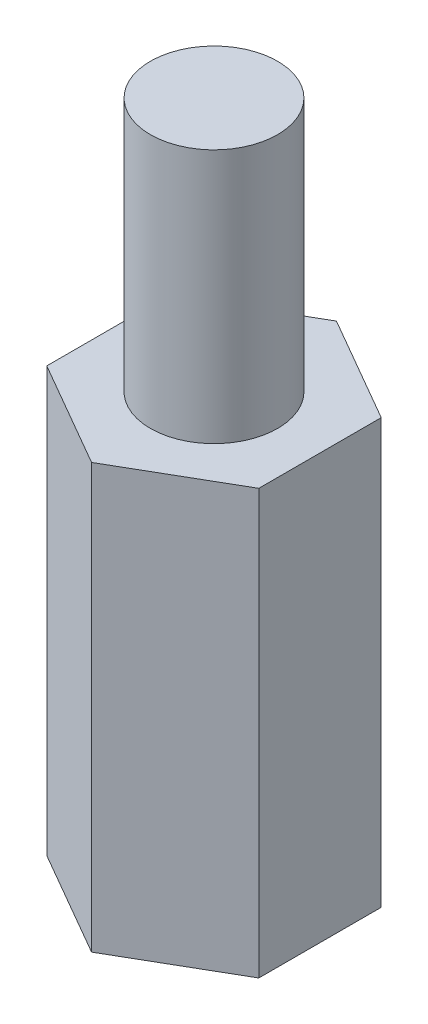
ISO-10303-21;
HEADER;
FILE_DESCRIPTION(('STEP AP214'),'2;1');
FILE_NAME('part.step','',(''),(''),'','','');
FILE_SCHEMA(('AUTOMOTIVE_DESIGN { 1 0 10303 214 1 1 1 1 }'));
ENDSEC;
DATA;
#1=APPLICATION_CONTEXT('core data for automotive mechanical design processes');
#2=APPLICATION_PROTOCOL_DEFINITION('international standard','automotive_design',2000,#1);
#3=PRODUCT_CONTEXT('',#1,'mechanical');
#4=PRODUCT('Part','Part','',(#3));
#5=PRODUCT_RELATED_PRODUCT_CATEGORY('part','',(#4));
#6=PRODUCT_DEFINITION_FORMATION('','',#4);
#7=PRODUCT_DEFINITION_CONTEXT('part definition',#1,'design');
#8=PRODUCT_DEFINITION('design','',#6,#7);
#9=PRODUCT_DEFINITION_SHAPE('','',#8);
#10=(LENGTH_UNIT() NAMED_UNIT(*) SI_UNIT(.MILLI.,.METRE.));
#11=(NAMED_UNIT(*) PLANE_ANGLE_UNIT() SI_UNIT($,.RADIAN.));
#12=(NAMED_UNIT(*) SI_UNIT($,.STERADIAN.) SOLID_ANGLE_UNIT());
#13=UNCERTAINTY_MEASURE_WITH_UNIT(LENGTH_MEASURE(1.E-05),#10,'distance_accuracy_value','');
#14=(GEOMETRIC_REPRESENTATION_CONTEXT(3) GLOBAL_UNCERTAINTY_ASSIGNED_CONTEXT((#13)) GLOBAL_UNIT_ASSIGNED_CONTEXT((#10,
#11,#12)) REPRESENTATION_CONTEXT('',''));
#15=CARTESIAN_POINT('',(0.,0.,0.));
#16=DIRECTION('',(0.,0.,1.));
#17=DIRECTION('',(1.,0.,0.));
#18=AXIS2_PLACEMENT_3D('',#15,#16,#17);
#19=CARTESIAN_POINT('',(2.5,16.,1.44337567297407));
#20=DIRECTION('',(-1.,0.,0.));
#21=DIRECTION('',(0.,0.,1.));
#22=AXIS2_PLACEMENT_3D('',#19,#20,#21);
#23=PLANE('',#22);
#24=DIRECTION('',(0.,0.,-1.));
#25=VECTOR('',#24,1.);
#26=CARTESIAN_POINT('',(2.50000000000001,10.,1.44337567297404));
#27=LINE('',#26,#25);
#28=CARTESIAN_POINT('',(2.50000000000001,10.,1.44337567297404));
#29=VERTEX_POINT('',#28);
#30=CARTESIAN_POINT('',(2.49999999999998,10.,-1.44337567297409));
#31=VERTEX_POINT('',#30);
#32=EDGE_CURVE('E90',#29,#31,#27,.T.);
#33=ORIENTED_EDGE('',*,*,#32,.F.);
#34=DIRECTION('',(0.,-1.,0.));
#35=VECTOR('',#34,1.);
#36=CARTESIAN_POINT('',(2.5,16.,1.44337567297407));
#37=LINE('',#36,#35);
#38=CARTESIAN_POINT('',(2.5,0.,1.44337567297407));
#39=VERTEX_POINT('',#38);
#40=EDGE_CURVE('E56',#29,#39,#37,.T.);
#41=ORIENTED_EDGE('',*,*,#40,.T.);
#42=DIRECTION('',(0.,0.,-1.));
#43=VECTOR('',#42,1.);
#44=CARTESIAN_POINT('',(2.5,0.,1.44337567297407));
#45=LINE('',#44,#43);
#46=CARTESIAN_POINT('',(2.5,0.,-1.44337567297407));
#47=VERTEX_POINT('',#46);
#48=EDGE_CURVE('E126',#39,#47,#45,.T.);
#49=ORIENTED_EDGE('',*,*,#48,.T.);
#50=DIRECTION('',(0.,-1.,0.));
#51=VECTOR('',#50,1.);
#52=CARTESIAN_POINT('',(2.5,16.,-1.44337567297407));
#53=LINE('',#52,#51);
#54=EDGE_CURVE('E11',#31,#47,#53,.T.);
#55=ORIENTED_EDGE('',*,*,#54,.F.);
#56=EDGE_LOOP('',(#33,#41,#49,#55));
#57=FACE_BOUND('',#56,.T.);
#58=ADVANCED_FACE('F34',(#57),#23,.F.);
#59=CARTESIAN_POINT('',(2.5,16.,-1.44337567297407));
#60=DIRECTION('',(-0.5,0.,0.866025403784439));
#61=DIRECTION('',(0.866025403784439,0.,0.5));
#62=AXIS2_PLACEMENT_3D('',#59,#60,#61);
#63=PLANE('',#62);
#64=DIRECTION('',(-0.866025403784442,0.,-0.499999999999995));
#65=VECTOR('',#64,1.);
#66=CARTESIAN_POINT('',(2.49999999999998,10.,-1.44337567297409));
#67=LINE('',#66,#65);
#68=CARTESIAN_POINT('',(0.,10.,-2.88675134594813));
#69=VERTEX_POINT('',#68);
#70=EDGE_CURVE('E85',#31,#69,#67,.T.);
#71=ORIENTED_EDGE('',*,*,#70,.F.);
#72=ORIENTED_EDGE('',*,*,#54,.T.);
#73=DIRECTION('',(-0.866025403784439,0.,-0.5));
#74=VECTOR('',#73,1.);
#75=CARTESIAN_POINT('',(2.5,0.,-1.44337567297407));
#76=LINE('',#75,#74);
#77=CARTESIAN_POINT('',(0.,0.,-2.88675134594813));
#78=VERTEX_POINT('',#77);
#79=EDGE_CURVE('E106',#47,#78,#76,.T.);
#80=ORIENTED_EDGE('',*,*,#79,.T.);
#81=DIRECTION('',(0.,-1.,0.));
#82=VECTOR('',#81,1.);
#83=CARTESIAN_POINT('',(0.,16.,-2.88675134594813));
#84=LINE('',#83,#82);
#85=EDGE_CURVE('E41',#69,#78,#84,.T.);
#86=ORIENTED_EDGE('',*,*,#85,.F.);
#87=EDGE_LOOP('',(#71,#72,#80,#86));
#88=FACE_BOUND('',#87,.T.);
#89=ADVANCED_FACE('F104',(#88),#63,.F.);
#90=CARTESIAN_POINT('',(0.,16.,-2.88675134594813));
#91=DIRECTION('',(0.5,0.,0.866025403784438));
#92=DIRECTION('',(0.866025403784438,0.,-0.5));
#93=AXIS2_PLACEMENT_3D('',#90,#91,#92);
#94=PLANE('',#93);
#95=DIRECTION('',(-0.866025403784438,0.,0.500000000000001));
#96=VECTOR('',#95,1.);
#97=CARTESIAN_POINT('',(0.,10.,-2.88675134594813));
#98=LINE('',#97,#96);
#99=CARTESIAN_POINT('',(-2.5,10.,-1.44337567297406));
#100=VERTEX_POINT('',#99);
#101=EDGE_CURVE('E88',#69,#100,#98,.T.);
#102=ORIENTED_EDGE('',*,*,#101,.F.);
#103=ORIENTED_EDGE('',*,*,#85,.T.);
#104=DIRECTION('',(-0.866025403784438,0.,0.5));
#105=VECTOR('',#104,1.);
#106=CARTESIAN_POINT('',(0.,0.,-2.88675134594813));
#107=LINE('',#106,#105);
#108=CARTESIAN_POINT('',(-2.5,0.,-1.44337567297406));
#109=VERTEX_POINT('',#108);
#110=EDGE_CURVE('E123',#78,#109,#107,.T.);
#111=ORIENTED_EDGE('',*,*,#110,.T.);
#112=DIRECTION('',(0.,-1.,0.));
#113=VECTOR('',#112,1.);
#114=CARTESIAN_POINT('',(-2.5,16.,-1.44337567297406));
#115=LINE('',#114,#113);
#116=EDGE_CURVE('E101',#100,#109,#115,.T.);
#117=ORIENTED_EDGE('',*,*,#116,.F.);
#118=EDGE_LOOP('',(#102,#103,#111,#117));
#119=FACE_BOUND('',#118,.T.);
#120=ADVANCED_FACE('F98',(#119),#94,.F.);
#121=CARTESIAN_POINT('',(-2.5,16.,-1.44337567297406));
#122=DIRECTION('',(1.,0.,0.));
#123=DIRECTION('',(0.,0.,-1.));
#124=AXIS2_PLACEMENT_3D('',#121,#122,#123);
#125=PLANE('',#124);
#126=DIRECTION('',(0.,0.,1.));
#127=VECTOR('',#126,1.);
#128=CARTESIAN_POINT('',(-2.5,10.,-1.44337567297406));
#129=LINE('',#128,#127);
#130=CARTESIAN_POINT('',(-2.49999999999999,10.,1.44337567297408));
#131=VERTEX_POINT('',#130);
#132=EDGE_CURVE('E102',#100,#131,#129,.T.);
#133=ORIENTED_EDGE('',*,*,#132,.F.);
#134=ORIENTED_EDGE('',*,*,#116,.T.);
#135=DIRECTION('',(0.,0.,1.));
#136=VECTOR('',#135,1.);
#137=CARTESIAN_POINT('',(-2.5,0.,-1.44337567297406));
#138=LINE('',#137,#136);
#139=CARTESIAN_POINT('',(-2.5,0.,1.44337567297407));
#140=VERTEX_POINT('',#139);
#141=EDGE_CURVE('E120',#109,#140,#138,.T.);
#142=ORIENTED_EDGE('',*,*,#141,.T.);
#143=DIRECTION('',(0.,-1.,0.));
#144=VECTOR('',#143,1.);
#145=CARTESIAN_POINT('',(-2.5,16.,1.44337567297407));
#146=LINE('',#145,#144);
#147=EDGE_CURVE('E108',#131,#140,#146,.T.);
#148=ORIENTED_EDGE('',*,*,#147,.F.);
#149=EDGE_LOOP('',(#133,#134,#142,#148));
#150=FACE_BOUND('',#149,.T.);
#151=ADVANCED_FACE('F175',(#150),#125,.F.);
#152=CARTESIAN_POINT('',(-2.5,16.,1.44337567297407));
#153=DIRECTION('',(0.5,0.,-0.866025403784439));
#154=DIRECTION('',(-0.866025403784439,0.,-0.5));
#155=AXIS2_PLACEMENT_3D('',#152,#153,#154);
#156=PLANE('',#155);
#157=DIRECTION('',(0.866025403784441,0.,0.499999999999995));
#158=VECTOR('',#157,1.);
#159=CARTESIAN_POINT('',(-2.49999999999999,10.,1.44337567297408));
#160=LINE('',#159,#158);
#161=CARTESIAN_POINT('',(0.,10.,2.88675134594813));
#162=VERTEX_POINT('',#161);
#163=EDGE_CURVE('E48',#131,#162,#160,.T.);
#164=ORIENTED_EDGE('',*,*,#163,.F.);
#165=ORIENTED_EDGE('',*,*,#147,.T.);
#166=DIRECTION('',(0.866025403784439,0.,0.5));
#167=VECTOR('',#166,1.);
#168=CARTESIAN_POINT('',(-2.5,0.,1.44337567297407));
#169=LINE('',#168,#167);
#170=CARTESIAN_POINT('',(0.,0.,2.88675134594813));
#171=VERTEX_POINT('',#170);
#172=EDGE_CURVE('E117',#140,#171,#169,.T.);
#173=ORIENTED_EDGE('',*,*,#172,.T.);
#174=DIRECTION('',(0.,-1.,0.));
#175=VECTOR('',#174,1.);
#176=CARTESIAN_POINT('',(0.,16.,2.88675134594813));
#177=LINE('',#176,#175);
#178=EDGE_CURVE('E112',#162,#171,#177,.T.);
#179=ORIENTED_EDGE('',*,*,#178,.F.);
#180=EDGE_LOOP('',(#164,#165,#173,#179));
#181=FACE_BOUND('',#180,.T.);
#182=ADVANCED_FACE('F177',(#181),#156,.F.);
#183=CARTESIAN_POINT('',(0.,16.,2.88675134594813));
#184=DIRECTION('',(-0.5,0.,-0.866025403784439));
#185=DIRECTION('',(-0.866025403784439,0.,0.5));
#186=AXIS2_PLACEMENT_3D('',#183,#184,#185);
#187=PLANE('',#186);
#188=DIRECTION('',(0.866025403784435,0.,-0.500000000000007));
#189=VECTOR('',#188,1.);
#190=CARTESIAN_POINT('',(0.,10.,2.88675134594813));
#191=LINE('',#190,#189);
#192=EDGE_CURVE('E135',#162,#29,#191,.T.);
#193=ORIENTED_EDGE('',*,*,#192,.F.);
#194=ORIENTED_EDGE('',*,*,#178,.T.);
#195=DIRECTION('',(0.866025403784439,0.,-0.5));
#196=VECTOR('',#195,1.);
#197=CARTESIAN_POINT('',(0.,0.,2.88675134594813));
#198=LINE('',#197,#196);
#199=EDGE_CURVE('E115',#171,#39,#198,.T.);
#200=ORIENTED_EDGE('',*,*,#199,.T.);
#201=ORIENTED_EDGE('',*,*,#40,.F.);
#202=EDGE_LOOP('',(#193,#194,#200,#201));
#203=FACE_BOUND('',#202,.T.);
#204=ADVANCED_FACE('F165',(#203),#187,.F.);
#205=CARTESIAN_POINT('',(0.,0.,0.));
#206=DIRECTION('',(0.,1.,0.));
#207=DIRECTION('',(0.,0.,1.));
#208=AXIS2_PLACEMENT_3D('',#205,#206,#207);
#209=PLANE('',#208);
#210=CARTESIAN_POINT('',(0.,0.,0.));
#211=DIRECTION('',(0.,1.,0.));
#212=DIRECTION('',(0.,0.,1.));
#213=AXIS2_PLACEMENT_3D('',#210,#211,#212);
#214=CIRCLE('',#213,1.5025);
#215=CARTESIAN_POINT('',(0.,0.,1.5025));
#216=VERTEX_POINT('',#215);
#217=EDGE_CURVE('E129',#216,#216,#214,.T.);
#218=ORIENTED_EDGE('',*,*,#217,.T.);
#219=EDGE_LOOP('',(#218));
#220=FACE_BOUND('',#219,.T.);
#221=ORIENTED_EDGE('',*,*,#48,.F.);
#222=ORIENTED_EDGE('',*,*,#199,.F.);
#223=ORIENTED_EDGE('',*,*,#172,.F.);
#224=ORIENTED_EDGE('',*,*,#141,.F.);
#225=ORIENTED_EDGE('',*,*,#110,.F.);
#226=ORIENTED_EDGE('',*,*,#79,.F.);
#227=EDGE_LOOP('',(#221,#222,#223,#224,#225,#226));
#228=FACE_BOUND('',#227,.T.);
#229=ADVANCED_FACE('F171',(#220,#228),#209,.F.);
#230=CARTESIAN_POINT('',(0.,6.005,0.));
#231=DIRECTION('',(0.,-1.,0.));
#232=DIRECTION('',(0.,0.,-1.));
#233=AXIS2_PLACEMENT_3D('',#230,#231,#232);
#234=CYLINDRICAL_SURFACE('',#233,1.5025);
#235=CARTESIAN_POINT('',(0.,6.005,0.));
#236=DIRECTION('',(0.,1.,0.));
#237=DIRECTION('',(0.,0.,1.));
#238=AXIS2_PLACEMENT_3D('',#235,#236,#237);
#239=CIRCLE('',#238,1.5025);
#240=CARTESIAN_POINT('',(0.,6.005,1.5025));
#241=VERTEX_POINT('',#240);
#242=EDGE_CURVE('E128',#241,#241,#239,.T.);
#243=ORIENTED_EDGE('',*,*,#242,.T.);
#244=EDGE_LOOP('',(#243));
#245=FACE_BOUND('',#244,.T.);
#246=ORIENTED_EDGE('',*,*,#217,.F.);
#247=EDGE_LOOP('',(#246));
#248=FACE_BOUND('',#247,.T.);
#249=ADVANCED_FACE('F157',(#245,#248),#234,.F.);
#250=CARTESIAN_POINT('',(0.,6.005,0.));
#251=DIRECTION('',(0.,1.,0.));
#252=DIRECTION('',(0.,0.,1.));
#253=AXIS2_PLACEMENT_3D('',#250,#251,#252);
#254=PLANE('',#253);
#255=ORIENTED_EDGE('',*,*,#242,.F.);
#256=EDGE_LOOP('',(#255));
#257=FACE_BOUND('',#256,.T.);
#258=ADVANCED_FACE('F149',(#257),#254,.F.);
#259=CARTESIAN_POINT('',(0.,10.,0.));
#260=DIRECTION('',(0.,1.,0.));
#261=DIRECTION('',(0.,0.,1.));
#262=AXIS2_PLACEMENT_3D('',#259,#260,#261);
#263=PLANE('',#262);
#264=CARTESIAN_POINT('',(0.,10.,0.));
#265=DIRECTION('',(0.,1.,0.));
#266=DIRECTION('',(0.,0.,1.));
#267=AXIS2_PLACEMENT_3D('',#264,#265,#266);
#268=CIRCLE('',#267,1.5);
#269=CARTESIAN_POINT('',(0.,10.,1.5));
#270=VERTEX_POINT('',#269);
#271=EDGE_CURVE('E94',#270,#270,#268,.T.);
#272=ORIENTED_EDGE('',*,*,#271,.F.);
#273=EDGE_LOOP('',(#272));
#274=FACE_BOUND('',#273,.T.);
#275=ORIENTED_EDGE('',*,*,#70,.T.);
#276=ORIENTED_EDGE('',*,*,#101,.T.);
#277=ORIENTED_EDGE('',*,*,#132,.T.);
#278=ORIENTED_EDGE('',*,*,#163,.T.);
#279=ORIENTED_EDGE('',*,*,#192,.T.);
#280=ORIENTED_EDGE('',*,*,#32,.T.);
#281=EDGE_LOOP('',(#275,#276,#277,#278,#279,#280));
#282=FACE_BOUND('',#281,.T.);
#283=ADVANCED_FACE('F87',(#274,#282),#263,.T.);
#284=CARTESIAN_POINT('',(0.,10.,0.));
#285=DIRECTION('',(0.,1.,0.));
#286=DIRECTION('',(0.,0.,1.));
#287=AXIS2_PLACEMENT_3D('',#284,#285,#286);
#288=CYLINDRICAL_SURFACE('',#287,1.5);
#289=ORIENTED_EDGE('',*,*,#271,.T.);
#290=EDGE_LOOP('',(#289));
#291=FACE_BOUND('',#290,.T.);
#292=CARTESIAN_POINT('',(0.,16.,0.));
#293=DIRECTION('',(0.,1.,0.));
#294=DIRECTION('',(0.,0.,1.));
#295=AXIS2_PLACEMENT_3D('',#292,#293,#294);
#296=CIRCLE('',#295,1.5);
#297=CARTESIAN_POINT('',(0.,16.,1.5));
#298=VERTEX_POINT('',#297);
#299=EDGE_CURVE('E139',#298,#298,#296,.T.);
#300=ORIENTED_EDGE('',*,*,#299,.F.);
#301=EDGE_LOOP('',(#300));
#302=FACE_BOUND('',#301,.T.);
#303=ADVANCED_FACE('F145',(#291,#302),#288,.T.);
#304=CARTESIAN_POINT('',(0.,16.,0.));
#305=DIRECTION('',(0.,1.,0.));
#306=DIRECTION('',(0.,0.,1.));
#307=AXIS2_PLACEMENT_3D('',#304,#305,#306);
#308=PLANE('',#307);
#309=ORIENTED_EDGE('',*,*,#299,.T.);
#310=EDGE_LOOP('',(#309));
#311=FACE_BOUND('',#310,.T.);
#312=ADVANCED_FACE('F155',(#311),#308,.T.);
#313=CLOSED_SHELL('',(#58,#89,#120,#151,#182,#204,#229,#249,#258,#283,#303,#312));
#314=MANIFOLD_SOLID_BREP('B2',#313);
#315=ADVANCED_BREP_SHAPE_REPRESENTATION('',(#18,#314),#14);
#316=SHAPE_DEFINITION_REPRESENTATION(#9,#315);
ENDSEC;
END-ISO-10303-21;
